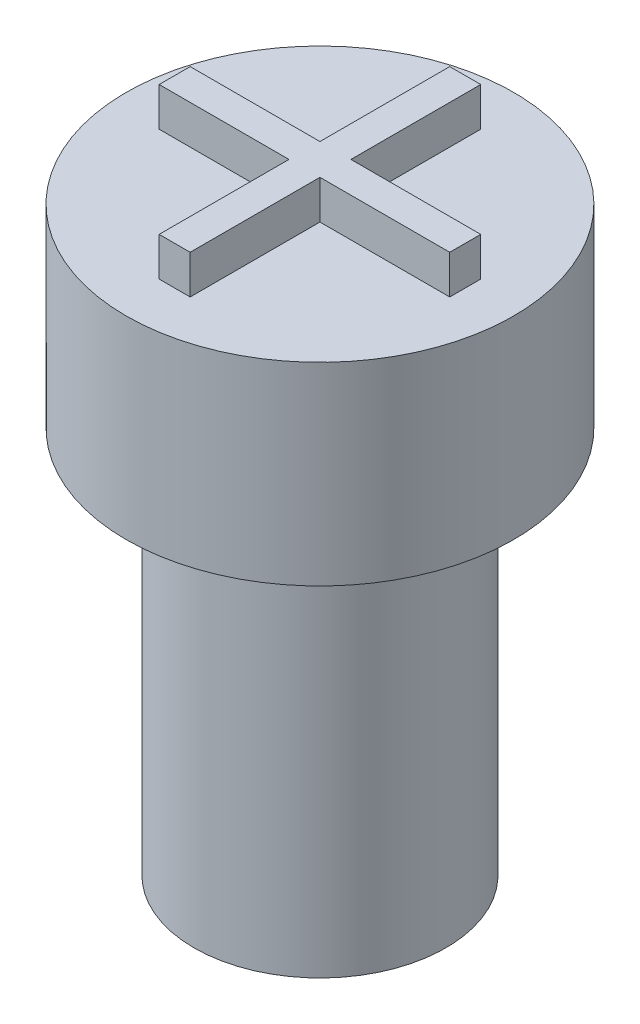
ISO-10303-21;
HEADER;
FILE_DESCRIPTION(('STEP AP214'),'2;1');
FILE_NAME('part.step','',(''),(''),'','','');
FILE_SCHEMA(('AUTOMOTIVE_DESIGN { 1 0 10303 214 1 1 1 1 }'));
ENDSEC;
DATA;
#1=APPLICATION_CONTEXT('core data for automotive mechanical design processes');
#2=APPLICATION_PROTOCOL_DEFINITION('international standard','automotive_design',2000,#1);
#3=PRODUCT_CONTEXT('',#1,'mechanical');
#4=PRODUCT('Part','Part','',(#3));
#5=PRODUCT_RELATED_PRODUCT_CATEGORY('part','',(#4));
#6=PRODUCT_DEFINITION_FORMATION('','',#4);
#7=PRODUCT_DEFINITION_CONTEXT('part definition',#1,'design');
#8=PRODUCT_DEFINITION('design','',#6,#7);
#9=PRODUCT_DEFINITION_SHAPE('','',#8);
#10=(LENGTH_UNIT() NAMED_UNIT(*) SI_UNIT(.MILLI.,.METRE.));
#11=(NAMED_UNIT(*) PLANE_ANGLE_UNIT() SI_UNIT($,.RADIAN.));
#12=(NAMED_UNIT(*) SI_UNIT($,.STERADIAN.) SOLID_ANGLE_UNIT());
#13=UNCERTAINTY_MEASURE_WITH_UNIT(LENGTH_MEASURE(1.E-05),#10,'distance_accuracy_value','');
#14=(GEOMETRIC_REPRESENTATION_CONTEXT(3) GLOBAL_UNCERTAINTY_ASSIGNED_CONTEXT((#13)) GLOBAL_UNIT_ASSIGNED_CONTEXT((#10,
#11,#12)) REPRESENTATION_CONTEXT('',''));
#15=CARTESIAN_POINT('',(0.,0.,0.));
#16=DIRECTION('',(0.,0.,1.));
#17=DIRECTION('',(1.,0.,0.));
#18=AXIS2_PLACEMENT_3D('',#15,#16,#17);
#19=CARTESIAN_POINT('',(0.,10.,0.));
#20=DIRECTION('',(0.,-1.,0.));
#21=DIRECTION('',(0.,0.,-1.));
#22=AXIS2_PLACEMENT_3D('',#19,#20,#21);
#23=CYLINDRICAL_SURFACE('',#22,3.25);
#24=CARTESIAN_POINT('',(0.,10.,0.));
#25=DIRECTION('',(0.,1.,0.));
#26=DIRECTION('',(0.,0.,1.));
#27=AXIS2_PLACEMENT_3D('',#24,#25,#26);
#28=CIRCLE('',#27,3.25);
#29=CARTESIAN_POINT('',(0.,10.,3.25));
#30=VERTEX_POINT('',#29);
#31=EDGE_CURVE('E11',#30,#30,#28,.T.);
#32=ORIENTED_EDGE('',*,*,#31,.F.);
#33=EDGE_LOOP('',(#32));
#34=FACE_BOUND('',#33,.T.);
#35=CARTESIAN_POINT('',(0.,0.,0.));
#36=DIRECTION('',(0.,1.,0.));
#37=DIRECTION('',(0.,0.,1.));
#38=AXIS2_PLACEMENT_3D('',#35,#36,#37);
#39=CIRCLE('',#38,3.25);
#40=CARTESIAN_POINT('',(0.,0.,3.25));
#41=VERTEX_POINT('',#40);
#42=EDGE_CURVE('E48',#41,#41,#39,.T.);
#43=ORIENTED_EDGE('',*,*,#42,.T.);
#44=EDGE_LOOP('',(#43));
#45=FACE_BOUND('',#44,.T.);
#46=ADVANCED_FACE('F45',(#34,#45),#23,.T.);
#47=CARTESIAN_POINT('',(0.,0.,0.));
#48=DIRECTION('',(0.,1.,0.));
#49=DIRECTION('',(0.,0.,1.));
#50=AXIS2_PLACEMENT_3D('',#47,#48,#49);
#51=PLANE('',#50);
#52=CARTESIAN_POINT('',(0.,0.,0.));
#53=DIRECTION('',(0.,-1.,0.));
#54=DIRECTION('',(0.,0.,-1.));
#55=AXIS2_PLACEMENT_3D('',#52,#53,#54);
#56=CIRCLE('',#55,1.75);
#57=CARTESIAN_POINT('',(0.,0.,-1.75));
#58=VERTEX_POINT('',#57);
#59=EDGE_CURVE('E170',#58,#58,#56,.T.);
#60=ORIENTED_EDGE('',*,*,#59,.F.);
#61=EDGE_LOOP('',(#60));
#62=FACE_BOUND('',#61,.T.);
#63=ORIENTED_EDGE('',*,*,#42,.F.);
#64=EDGE_LOOP('',(#63));
#65=FACE_BOUND('',#64,.T.);
#66=ADVANCED_FACE('F182',(#62,#65),#51,.F.);
#67=CARTESIAN_POINT('',(0.,2.5,0.));
#68=DIRECTION('',(0.,-1.,0.));
#69=DIRECTION('',(0.,0.,-1.));
#70=AXIS2_PLACEMENT_3D('',#67,#68,#69);
#71=CYLINDRICAL_SURFACE('',#70,1.75);
#72=CARTESIAN_POINT('',(0.,2.5,0.));
#73=DIRECTION('',(0.,-1.,0.));
#74=DIRECTION('',(0.,0.,-1.));
#75=AXIS2_PLACEMENT_3D('',#72,#73,#74);
#76=CIRCLE('',#75,1.75);
#77=CARTESIAN_POINT('',(0.,2.5,-1.75));
#78=VERTEX_POINT('',#77);
#79=EDGE_CURVE('E172',#78,#78,#76,.T.);
#80=ORIENTED_EDGE('',*,*,#79,.F.);
#81=EDGE_LOOP('',(#80));
#82=FACE_BOUND('',#81,.T.);
#83=ORIENTED_EDGE('',*,*,#59,.T.);
#84=EDGE_LOOP('',(#83));
#85=FACE_BOUND('',#84,.T.);
#86=ADVANCED_FACE('F180',(#82,#85),#71,.F.);
#87=CARTESIAN_POINT('',(0.,2.5,0.));
#88=DIRECTION('',(0.,-1.,0.));
#89=DIRECTION('',(0.,0.,-1.));
#90=AXIS2_PLACEMENT_3D('',#87,#88,#89);
#91=PLANE('',#90);
#92=ORIENTED_EDGE('',*,*,#79,.T.);
#93=EDGE_LOOP('',(#92));
#94=FACE_BOUND('',#93,.T.);
#95=ADVANCED_FACE('F204',(#94),#91,.T.);
#96=CARTESIAN_POINT('',(0.,15.,0.));
#97=DIRECTION('',(0.,-1.,0.));
#98=DIRECTION('',(0.,0.,-1.));
#99=AXIS2_PLACEMENT_3D('',#96,#97,#98);
#100=CYLINDRICAL_SURFACE('',#99,5.);
#101=CARTESIAN_POINT('',(0.,15.,0.));
#102=DIRECTION('',(0.,1.,0.));
#103=DIRECTION('',(0.,0.,1.));
#104=AXIS2_PLACEMENT_3D('',#101,#102,#103);
#105=CIRCLE('',#104,5.);
#106=CARTESIAN_POINT('',(0.,15.,5.));
#107=VERTEX_POINT('',#106);
#108=EDGE_CURVE('E162',#107,#107,#105,.T.);
#109=ORIENTED_EDGE('',*,*,#108,.F.);
#110=EDGE_LOOP('',(#109));
#111=FACE_BOUND('',#110,.T.);
#112=CARTESIAN_POINT('',(0.,10.,0.));
#113=DIRECTION('',(0.,1.,0.));
#114=DIRECTION('',(0.,0.,1.));
#115=AXIS2_PLACEMENT_3D('',#112,#113,#114);
#116=CIRCLE('',#115,5.);
#117=CARTESIAN_POINT('',(0.,10.,5.));
#118=VERTEX_POINT('',#117);
#119=EDGE_CURVE('E157',#118,#118,#116,.T.);
#120=ORIENTED_EDGE('',*,*,#119,.T.);
#121=EDGE_LOOP('',(#120));
#122=FACE_BOUND('',#121,.T.);
#123=ADVANCED_FACE('F202',(#111,#122),#100,.T.);
#124=CARTESIAN_POINT('',(0.,15.,0.));
#125=DIRECTION('',(0.,1.,0.));
#126=DIRECTION('',(0.,0.,1.));
#127=AXIS2_PLACEMENT_3D('',#124,#125,#126);
#128=PLANE('',#127);
#129=DIRECTION('',(0.,0.,-1.));
#130=VECTOR('',#129,1.);
#131=CARTESIAN_POINT('',(0.4,15.,-0.399999999999999));
#132=LINE('',#131,#130);
#133=CARTESIAN_POINT('',(0.4,15.,-0.399999999999999));
#134=VERTEX_POINT('',#133);
#135=CARTESIAN_POINT('',(0.4,15.,-3.75));
#136=VERTEX_POINT('',#135);
#137=EDGE_CURVE('E60',#134,#136,#132,.T.);
#138=ORIENTED_EDGE('',*,*,#137,.F.);
#139=DIRECTION('',(-1.,0.,0.));
#140=VECTOR('',#139,1.);
#141=CARTESIAN_POINT('',(3.75,15.,-0.399999999999999));
#142=LINE('',#141,#140);
#143=CARTESIAN_POINT('',(3.75,15.,-0.399999999999999));
#144=VERTEX_POINT('',#143);
#145=EDGE_CURVE('E64',#144,#134,#142,.T.);
#146=ORIENTED_EDGE('',*,*,#145,.F.);
#147=DIRECTION('',(0.,0.,-1.));
#148=VECTOR('',#147,1.);
#149=CARTESIAN_POINT('',(3.75,15.,0.400000000000001));
#150=LINE('',#149,#148);
#151=CARTESIAN_POINT('',(3.75,15.,0.400000000000001));
#152=VERTEX_POINT('',#151);
#153=EDGE_CURVE('E377',#152,#144,#150,.T.);
#154=ORIENTED_EDGE('',*,*,#153,.F.);
#155=DIRECTION('',(1.,0.,0.));
#156=VECTOR('',#155,1.);
#157=CARTESIAN_POINT('',(0.4,15.,0.400000000000001));
#158=LINE('',#157,#156);
#159=CARTESIAN_POINT('',(0.4,15.,0.400000000000001));
#160=VERTEX_POINT('',#159);
#161=EDGE_CURVE('E454',#160,#152,#158,.T.);
#162=ORIENTED_EDGE('',*,*,#161,.F.);
#163=DIRECTION('',(0.,0.,-1.));
#164=VECTOR('',#163,1.);
#165=CARTESIAN_POINT('',(0.4,15.,3.75));
#166=LINE('',#165,#164);
#167=CARTESIAN_POINT('',(0.4,15.,3.75));
#168=VERTEX_POINT('',#167);
#169=EDGE_CURVE('E450',#168,#160,#166,.T.);
#170=ORIENTED_EDGE('',*,*,#169,.F.);
#171=DIRECTION('',(1.,0.,0.));
#172=VECTOR('',#171,1.);
#173=CARTESIAN_POINT('',(-0.4,15.,3.75));
#174=LINE('',#173,#172);
#175=CARTESIAN_POINT('',(-0.4,15.,3.75));
#176=VERTEX_POINT('',#175);
#177=EDGE_CURVE('E446',#176,#168,#174,.T.);
#178=ORIENTED_EDGE('',*,*,#177,.F.);
#179=DIRECTION('',(0.,0.,1.));
#180=VECTOR('',#179,1.);
#181=CARTESIAN_POINT('',(-0.4,15.,0.400000000000001));
#182=LINE('',#181,#180);
#183=CARTESIAN_POINT('',(-0.4,15.,0.400000000000001));
#184=VERTEX_POINT('',#183);
#185=EDGE_CURVE('E442',#184,#176,#182,.T.);
#186=ORIENTED_EDGE('',*,*,#185,.F.);
#187=DIRECTION('',(1.,0.,0.));
#188=VECTOR('',#187,1.);
#189=CARTESIAN_POINT('',(-3.75,15.,0.400000000000001));
#190=LINE('',#189,#188);
#191=CARTESIAN_POINT('',(-3.75,15.,0.400000000000001));
#192=VERTEX_POINT('',#191);
#193=EDGE_CURVE('E438',#192,#184,#190,.T.);
#194=ORIENTED_EDGE('',*,*,#193,.F.);
#195=DIRECTION('',(0.,0.,1.));
#196=VECTOR('',#195,1.);
#197=CARTESIAN_POINT('',(-3.75,15.,-0.399999999999999));
#198=LINE('',#197,#196);
#199=CARTESIAN_POINT('',(-3.75,15.,-0.399999999999999));
#200=VERTEX_POINT('',#199);
#201=EDGE_CURVE('E430',#200,#192,#198,.T.);
#202=ORIENTED_EDGE('',*,*,#201,.F.);
#203=DIRECTION('',(-1.,0.,0.));
#204=VECTOR('',#203,1.);
#205=CARTESIAN_POINT('',(-0.4,15.,-0.399999999999999));
#206=LINE('',#205,#204);
#207=CARTESIAN_POINT('',(-0.4,15.,-0.399999999999999));
#208=VERTEX_POINT('',#207);
#209=EDGE_CURVE('E421',#208,#200,#206,.T.);
#210=ORIENTED_EDGE('',*,*,#209,.F.);
#211=DIRECTION('',(0.,0.,1.));
#212=VECTOR('',#211,1.);
#213=CARTESIAN_POINT('',(-0.4,15.,-3.75));
#214=LINE('',#213,#212);
#215=CARTESIAN_POINT('',(-0.4,15.,-3.75));
#216=VERTEX_POINT('',#215);
#217=EDGE_CURVE('E424',#216,#208,#214,.T.);
#218=ORIENTED_EDGE('',*,*,#217,.F.);
#219=DIRECTION('',(-1.,0.,0.));
#220=VECTOR('',#219,1.);
#221=CARTESIAN_POINT('',(0.4,15.,-3.75));
#222=LINE('',#221,#220);
#223=EDGE_CURVE('E426',#136,#216,#222,.T.);
#224=ORIENTED_EDGE('',*,*,#223,.F.);
#225=EDGE_LOOP('',(#138,#146,#154,#162,#170,#178,#186,#194,#202,#210,#218,#224));
#226=FACE_BOUND('',#225,.T.);
#227=ORIENTED_EDGE('',*,*,#108,.T.);
#228=EDGE_LOOP('',(#227));
#229=FACE_BOUND('',#228,.T.);
#230=ADVANCED_FACE('F198',(#226,#229),#128,.T.);
#231=CARTESIAN_POINT('',(0.,10.,0.));
#232=DIRECTION('',(0.,1.,0.));
#233=DIRECTION('',(0.,0.,1.));
#234=AXIS2_PLACEMENT_3D('',#231,#232,#233);
#235=PLANE('',#234);
#236=ORIENTED_EDGE('',*,*,#31,.T.);
#237=EDGE_LOOP('',(#236));
#238=FACE_BOUND('',#237,.T.);
#239=ORIENTED_EDGE('',*,*,#119,.F.);
#240=EDGE_LOOP('',(#239));
#241=FACE_BOUND('',#240,.T.);
#242=ADVANCED_FACE('F195',(#238,#241),#235,.F.);
#243=CARTESIAN_POINT('',(0.4,16.,-0.399999999999999));
#244=DIRECTION('',(-1.,0.,0.));
#245=DIRECTION('',(0.,0.,1.));
#246=AXIS2_PLACEMENT_3D('',#243,#244,#245);
#247=PLANE('',#246);
#248=ORIENTED_EDGE('',*,*,#137,.T.);
#249=DIRECTION('',(0.,-1.,0.));
#250=VECTOR('',#249,1.);
#251=CARTESIAN_POINT('',(0.4,16.,-3.75));
#252=LINE('',#251,#250);
#253=CARTESIAN_POINT('',(0.4,16.,-3.75));
#254=VERTEX_POINT('',#253);
#255=EDGE_CURVE('E137',#254,#136,#252,.T.);
#256=ORIENTED_EDGE('',*,*,#255,.F.);
#257=DIRECTION('',(0.,0.,-1.));
#258=VECTOR('',#257,1.);
#259=CARTESIAN_POINT('',(0.4,16.,-0.399999999999999));
#260=LINE('',#259,#258);
#261=CARTESIAN_POINT('',(0.4,16.,-0.399999999999999));
#262=VERTEX_POINT('',#261);
#263=EDGE_CURVE('E144',#262,#254,#260,.T.);
#264=ORIENTED_EDGE('',*,*,#263,.F.);
#265=DIRECTION('',(0.,-1.,0.));
#266=VECTOR('',#265,1.);
#267=CARTESIAN_POINT('',(0.4,16.,-0.399999999999999));
#268=LINE('',#267,#266);
#269=EDGE_CURVE('E373',#262,#134,#268,.T.);
#270=ORIENTED_EDGE('',*,*,#269,.T.);
#271=EDGE_LOOP('',(#248,#256,#264,#270));
#272=FACE_BOUND('',#271,.T.);
#273=ADVANCED_FACE('F155',(#272),#247,.F.);
#274=CARTESIAN_POINT('',(0.4,16.,-3.75));
#275=DIRECTION('',(0.,0.,1.));
#276=DIRECTION('',(1.,0.,0.));
#277=AXIS2_PLACEMENT_3D('',#274,#275,#276);
#278=PLANE('',#277);
#279=ORIENTED_EDGE('',*,*,#223,.T.);
#280=DIRECTION('',(0.,-1.,0.));
#281=VECTOR('',#280,1.);
#282=CARTESIAN_POINT('',(-0.4,16.,-3.75));
#283=LINE('',#282,#281);
#284=CARTESIAN_POINT('',(-0.4,16.,-3.75));
#285=VERTEX_POINT('',#284);
#286=EDGE_CURVE('E139',#285,#216,#283,.T.);
#287=ORIENTED_EDGE('',*,*,#286,.F.);
#288=DIRECTION('',(-1.,0.,0.));
#289=VECTOR('',#288,1.);
#290=CARTESIAN_POINT('',(0.4,16.,-3.75));
#291=LINE('',#290,#289);
#292=EDGE_CURVE('E132',#254,#285,#291,.T.);
#293=ORIENTED_EDGE('',*,*,#292,.F.);
#294=ORIENTED_EDGE('',*,*,#255,.T.);
#295=EDGE_LOOP('',(#279,#287,#293,#294));
#296=FACE_BOUND('',#295,.T.);
#297=ADVANCED_FACE('F135',(#296),#278,.F.);
#298=CARTESIAN_POINT('',(-0.4,16.,-3.75));
#299=DIRECTION('',(1.,0.,0.));
#300=DIRECTION('',(0.,0.,-1.));
#301=AXIS2_PLACEMENT_3D('',#298,#299,#300);
#302=PLANE('',#301);
#303=ORIENTED_EDGE('',*,*,#217,.T.);
#304=DIRECTION('',(0.,-1.,0.));
#305=VECTOR('',#304,1.);
#306=CARTESIAN_POINT('',(-0.4,16.,-0.399999999999999));
#307=LINE('',#306,#305);
#308=CARTESIAN_POINT('',(-0.4,16.,-0.399999999999999));
#309=VERTEX_POINT('',#308);
#310=EDGE_CURVE('E164',#309,#208,#307,.T.);
#311=ORIENTED_EDGE('',*,*,#310,.F.);
#312=DIRECTION('',(0.,0.,1.));
#313=VECTOR('',#312,1.);
#314=CARTESIAN_POINT('',(-0.4,16.,-3.75));
#315=LINE('',#314,#313);
#316=EDGE_CURVE('E143',#285,#309,#315,.T.);
#317=ORIENTED_EDGE('',*,*,#316,.F.);
#318=ORIENTED_EDGE('',*,*,#286,.T.);
#319=EDGE_LOOP('',(#303,#311,#317,#318));
#320=FACE_BOUND('',#319,.T.);
#321=ADVANCED_FACE('F262',(#320),#302,.F.);
#322=CARTESIAN_POINT('',(-0.4,16.,-0.399999999999999));
#323=DIRECTION('',(0.,0.,1.));
#324=DIRECTION('',(1.,0.,0.));
#325=AXIS2_PLACEMENT_3D('',#322,#323,#324);
#326=PLANE('',#325);
#327=ORIENTED_EDGE('',*,*,#209,.T.);
#328=DIRECTION('',(0.,-1.,0.));
#329=VECTOR('',#328,1.);
#330=CARTESIAN_POINT('',(-3.75,16.,-0.399999999999999));
#331=LINE('',#330,#329);
#332=CARTESIAN_POINT('',(-3.75,16.,-0.399999999999999));
#333=VERTEX_POINT('',#332);
#334=EDGE_CURVE('E412',#333,#200,#331,.T.);
#335=ORIENTED_EDGE('',*,*,#334,.F.);
#336=DIRECTION('',(-1.,0.,0.));
#337=VECTOR('',#336,1.);
#338=CARTESIAN_POINT('',(-0.4,16.,-0.399999999999999));
#339=LINE('',#338,#337);
#340=EDGE_CURVE('E422',#309,#333,#339,.T.);
#341=ORIENTED_EDGE('',*,*,#340,.F.);
#342=ORIENTED_EDGE('',*,*,#310,.T.);
#343=EDGE_LOOP('',(#327,#335,#341,#342));
#344=FACE_BOUND('',#343,.T.);
#345=ADVANCED_FACE('F271',(#344),#326,.F.);
#346=CARTESIAN_POINT('',(-3.75,16.,-0.399999999999999));
#347=DIRECTION('',(1.,0.,0.));
#348=DIRECTION('',(0.,0.,-1.));
#349=AXIS2_PLACEMENT_3D('',#346,#347,#348);
#350=PLANE('',#349);
#351=ORIENTED_EDGE('',*,*,#201,.T.);
#352=DIRECTION('',(0.,-1.,0.));
#353=VECTOR('',#352,1.);
#354=CARTESIAN_POINT('',(-3.75,16.,0.400000000000001));
#355=LINE('',#354,#353);
#356=CARTESIAN_POINT('',(-3.75,16.,0.400000000000001));
#357=VERTEX_POINT('',#356);
#358=EDGE_CURVE('E408',#357,#192,#355,.T.);
#359=ORIENTED_EDGE('',*,*,#358,.F.);
#360=DIRECTION('',(0.,0.,1.));
#361=VECTOR('',#360,1.);
#362=CARTESIAN_POINT('',(-3.75,16.,-0.399999999999999));
#363=LINE('',#362,#361);
#364=EDGE_CURVE('E477',#333,#357,#363,.T.);
#365=ORIENTED_EDGE('',*,*,#364,.F.);
#366=ORIENTED_EDGE('',*,*,#334,.T.);
#367=EDGE_LOOP('',(#351,#359,#365,#366));
#368=FACE_BOUND('',#367,.T.);
#369=ADVANCED_FACE('F281',(#368),#350,.F.);
#370=CARTESIAN_POINT('',(-3.75,16.,0.400000000000001));
#371=DIRECTION('',(0.,0.,-1.));
#372=DIRECTION('',(-1.,0.,0.));
#373=AXIS2_PLACEMENT_3D('',#370,#371,#372);
#374=PLANE('',#373);
#375=ORIENTED_EDGE('',*,*,#193,.T.);
#376=DIRECTION('',(0.,-1.,0.));
#377=VECTOR('',#376,1.);
#378=CARTESIAN_POINT('',(-0.4,16.,0.400000000000001));
#379=LINE('',#378,#377);
#380=CARTESIAN_POINT('',(-0.4,16.,0.400000000000001));
#381=VERTEX_POINT('',#380);
#382=EDGE_CURVE('E404',#381,#184,#379,.T.);
#383=ORIENTED_EDGE('',*,*,#382,.F.);
#384=DIRECTION('',(1.,0.,0.));
#385=VECTOR('',#384,1.);
#386=CARTESIAN_POINT('',(-3.75,16.,0.400000000000001));
#387=LINE('',#386,#385);
#388=EDGE_CURVE('E475',#357,#381,#387,.T.);
#389=ORIENTED_EDGE('',*,*,#388,.F.);
#390=ORIENTED_EDGE('',*,*,#358,.T.);
#391=EDGE_LOOP('',(#375,#383,#389,#390));
#392=FACE_BOUND('',#391,.T.);
#393=ADVANCED_FACE('F291',(#392),#374,.F.);
#394=CARTESIAN_POINT('',(-0.4,16.,0.400000000000001));
#395=DIRECTION('',(1.,0.,0.));
#396=DIRECTION('',(0.,0.,-1.));
#397=AXIS2_PLACEMENT_3D('',#394,#395,#396);
#398=PLANE('',#397);
#399=ORIENTED_EDGE('',*,*,#185,.T.);
#400=DIRECTION('',(0.,-1.,0.));
#401=VECTOR('',#400,1.);
#402=CARTESIAN_POINT('',(-0.4,16.,3.75));
#403=LINE('',#402,#401);
#404=CARTESIAN_POINT('',(-0.4,16.,3.75));
#405=VERTEX_POINT('',#404);
#406=EDGE_CURVE('E400',#405,#176,#403,.T.);
#407=ORIENTED_EDGE('',*,*,#406,.F.);
#408=DIRECTION('',(0.,0.,1.));
#409=VECTOR('',#408,1.);
#410=CARTESIAN_POINT('',(-0.4,16.,0.400000000000001));
#411=LINE('',#410,#409);
#412=EDGE_CURVE('E471',#381,#405,#411,.T.);
#413=ORIENTED_EDGE('',*,*,#412,.F.);
#414=ORIENTED_EDGE('',*,*,#382,.T.);
#415=EDGE_LOOP('',(#399,#407,#413,#414));
#416=FACE_BOUND('',#415,.T.);
#417=ADVANCED_FACE('F301',(#416),#398,.F.);
#418=CARTESIAN_POINT('',(-0.4,16.,3.75));
#419=DIRECTION('',(0.,0.,-1.));
#420=DIRECTION('',(-1.,0.,0.));
#421=AXIS2_PLACEMENT_3D('',#418,#419,#420);
#422=PLANE('',#421);
#423=ORIENTED_EDGE('',*,*,#177,.T.);
#424=DIRECTION('',(0.,-1.,0.));
#425=VECTOR('',#424,1.);
#426=CARTESIAN_POINT('',(0.4,16.,3.75));
#427=LINE('',#426,#425);
#428=CARTESIAN_POINT('',(0.4,16.,3.75));
#429=VERTEX_POINT('',#428);
#430=EDGE_CURVE('E396',#429,#168,#427,.T.);
#431=ORIENTED_EDGE('',*,*,#430,.F.);
#432=DIRECTION('',(1.,0.,0.));
#433=VECTOR('',#432,1.);
#434=CARTESIAN_POINT('',(-0.4,16.,3.75));
#435=LINE('',#434,#433);
#436=EDGE_CURVE('E469',#405,#429,#435,.T.);
#437=ORIENTED_EDGE('',*,*,#436,.F.);
#438=ORIENTED_EDGE('',*,*,#406,.T.);
#439=EDGE_LOOP('',(#423,#431,#437,#438));
#440=FACE_BOUND('',#439,.T.);
#441=ADVANCED_FACE('F311',(#440),#422,.F.);
#442=CARTESIAN_POINT('',(0.4,16.,3.75));
#443=DIRECTION('',(-1.,0.,0.));
#444=DIRECTION('',(0.,0.,1.));
#445=AXIS2_PLACEMENT_3D('',#442,#443,#444);
#446=PLANE('',#445);
#447=ORIENTED_EDGE('',*,*,#169,.T.);
#448=DIRECTION('',(0.,-1.,0.));
#449=VECTOR('',#448,1.);
#450=CARTESIAN_POINT('',(0.4,16.,0.400000000000001));
#451=LINE('',#450,#449);
#452=CARTESIAN_POINT('',(0.4,16.,0.400000000000001));
#453=VERTEX_POINT('',#452);
#454=EDGE_CURVE('E392',#453,#160,#451,.T.);
#455=ORIENTED_EDGE('',*,*,#454,.F.);
#456=DIRECTION('',(0.,0.,-1.));
#457=VECTOR('',#456,1.);
#458=CARTESIAN_POINT('',(0.4,16.,3.75));
#459=LINE('',#458,#457);
#460=EDGE_CURVE('E465',#429,#453,#459,.T.);
#461=ORIENTED_EDGE('',*,*,#460,.F.);
#462=ORIENTED_EDGE('',*,*,#430,.T.);
#463=EDGE_LOOP('',(#447,#455,#461,#462));
#464=FACE_BOUND('',#463,.T.);
#465=ADVANCED_FACE('F321',(#464),#446,.F.);
#466=CARTESIAN_POINT('',(0.4,16.,0.400000000000001));
#467=DIRECTION('',(0.,0.,-1.));
#468=DIRECTION('',(-1.,0.,0.));
#469=AXIS2_PLACEMENT_3D('',#466,#467,#468);
#470=PLANE('',#469);
#471=ORIENTED_EDGE('',*,*,#161,.T.);
#472=DIRECTION('',(0.,-1.,0.));
#473=VECTOR('',#472,1.);
#474=CARTESIAN_POINT('',(3.75,16.,0.400000000000001));
#475=LINE('',#474,#473);
#476=CARTESIAN_POINT('',(3.75,16.,0.400000000000001));
#477=VERTEX_POINT('',#476);
#478=EDGE_CURVE('E383',#477,#152,#475,.T.);
#479=ORIENTED_EDGE('',*,*,#478,.F.);
#480=DIRECTION('',(1.,0.,0.));
#481=VECTOR('',#480,1.);
#482=CARTESIAN_POINT('',(0.4,16.,0.400000000000001));
#483=LINE('',#482,#481);
#484=EDGE_CURVE('E463',#453,#477,#483,.T.);
#485=ORIENTED_EDGE('',*,*,#484,.F.);
#486=ORIENTED_EDGE('',*,*,#454,.T.);
#487=EDGE_LOOP('',(#471,#479,#485,#486));
#488=FACE_BOUND('',#487,.T.);
#489=ADVANCED_FACE('F331',(#488),#470,.F.);
#490=CARTESIAN_POINT('',(3.75,16.,0.400000000000001));
#491=DIRECTION('',(-1.,0.,0.));
#492=DIRECTION('',(0.,0.,1.));
#493=AXIS2_PLACEMENT_3D('',#490,#491,#492);
#494=PLANE('',#493);
#495=ORIENTED_EDGE('',*,*,#153,.T.);
#496=DIRECTION('',(0.,-1.,0.));
#497=VECTOR('',#496,1.);
#498=CARTESIAN_POINT('',(3.75,16.,-0.399999999999999));
#499=LINE('',#498,#497);
#500=CARTESIAN_POINT('',(3.75,16.,-0.399999999999999));
#501=VERTEX_POINT('',#500);
#502=EDGE_CURVE('E375',#501,#144,#499,.T.);
#503=ORIENTED_EDGE('',*,*,#502,.F.);
#504=DIRECTION('',(0.,0.,-1.));
#505=VECTOR('',#504,1.);
#506=CARTESIAN_POINT('',(3.75,16.,0.400000000000001));
#507=LINE('',#506,#505);
#508=EDGE_CURVE('E385',#477,#501,#507,.T.);
#509=ORIENTED_EDGE('',*,*,#508,.F.);
#510=ORIENTED_EDGE('',*,*,#478,.T.);
#511=EDGE_LOOP('',(#495,#503,#509,#510));
#512=FACE_BOUND('',#511,.T.);
#513=ADVANCED_FACE('F341',(#512),#494,.F.);
#514=CARTESIAN_POINT('',(3.75,16.,-0.399999999999999));
#515=DIRECTION('',(0.,0.,1.));
#516=DIRECTION('',(1.,0.,0.));
#517=AXIS2_PLACEMENT_3D('',#514,#515,#516);
#518=PLANE('',#517);
#519=ORIENTED_EDGE('',*,*,#145,.T.);
#520=ORIENTED_EDGE('',*,*,#269,.F.);
#521=DIRECTION('',(-1.,0.,0.));
#522=VECTOR('',#521,1.);
#523=CARTESIAN_POINT('',(3.75,16.,-0.399999999999999));
#524=LINE('',#523,#522);
#525=EDGE_CURVE('E149',#501,#262,#524,.T.);
#526=ORIENTED_EDGE('',*,*,#525,.F.);
#527=ORIENTED_EDGE('',*,*,#502,.T.);
#528=EDGE_LOOP('',(#519,#520,#526,#527));
#529=FACE_BOUND('',#528,.T.);
#530=ADVANCED_FACE('F351',(#529),#518,.F.);
#531=CARTESIAN_POINT('',(0.,16.,0.));
#532=DIRECTION('',(0.,1.,0.));
#533=DIRECTION('',(0.,0.,1.));
#534=AXIS2_PLACEMENT_3D('',#531,#532,#533);
#535=PLANE('',#534);
#536=ORIENTED_EDGE('',*,*,#263,.T.);
#537=ORIENTED_EDGE('',*,*,#292,.T.);
#538=ORIENTED_EDGE('',*,*,#316,.T.);
#539=ORIENTED_EDGE('',*,*,#340,.T.);
#540=ORIENTED_EDGE('',*,*,#364,.T.);
#541=ORIENTED_EDGE('',*,*,#388,.T.);
#542=ORIENTED_EDGE('',*,*,#412,.T.);
#543=ORIENTED_EDGE('',*,*,#436,.T.);
#544=ORIENTED_EDGE('',*,*,#460,.T.);
#545=ORIENTED_EDGE('',*,*,#484,.T.);
#546=ORIENTED_EDGE('',*,*,#508,.T.);
#547=ORIENTED_EDGE('',*,*,#525,.T.);
#548=EDGE_LOOP('',(#536,#537,#538,#539,#540,#541,#542,#543,#544,#545,#546,#547));
#549=FACE_BOUND('',#548,.T.);
#550=ADVANCED_FACE('F147',(#549),#535,.T.);
#551=CLOSED_SHELL('',(#46,#66,#86,#95,#123,#230,#242,#273,#297,#321,#345,#369,#393,#417,#441,
#465,#489,#513,#530,#550));
#552=MANIFOLD_SOLID_BREP('B2',#551);
#553=ADVANCED_BREP_SHAPE_REPRESENTATION('',(#18,#552),#14);
#554=SHAPE_DEFINITION_REPRESENTATION(#9,#553);
ENDSEC;
END-ISO-10303-21;
